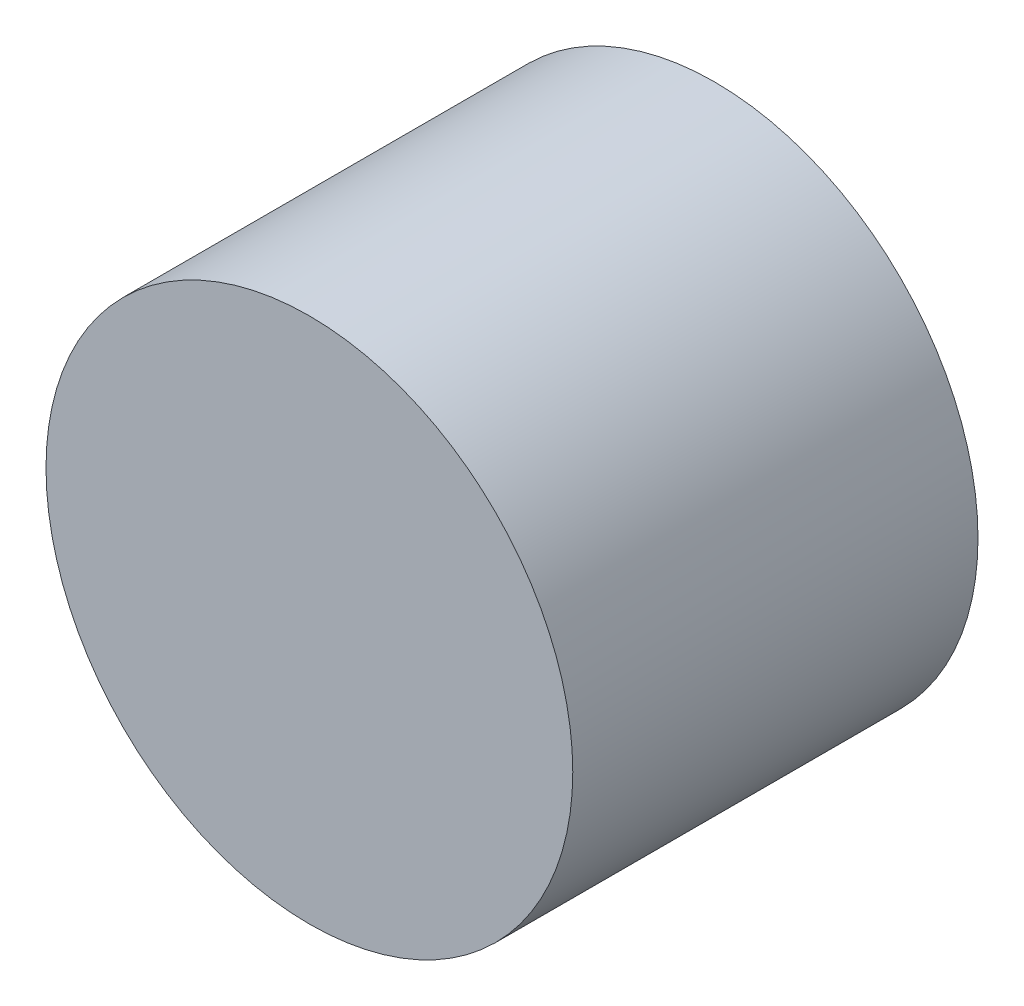
ISO-10303-21;
HEADER;
FILE_DESCRIPTION(('STEP AP214'),'2;1');
FILE_NAME('part.step','',(''),(''),'','','');
FILE_SCHEMA(('AUTOMOTIVE_DESIGN { 1 0 10303 214 1 1 1 1 }'));
ENDSEC;
DATA;
#1=APPLICATION_CONTEXT('core data for automotive mechanical design processes');
#2=APPLICATION_PROTOCOL_DEFINITION('international standard','automotive_design',2000,#1);
#3=PRODUCT_CONTEXT('',#1,'mechanical');
#4=PRODUCT('Part','Part','',(#3));
#5=PRODUCT_RELATED_PRODUCT_CATEGORY('part','',(#4));
#6=PRODUCT_DEFINITION_FORMATION('','',#4);
#7=PRODUCT_DEFINITION_CONTEXT('part definition',#1,'design');
#8=PRODUCT_DEFINITION('design','',#6,#7);
#9=PRODUCT_DEFINITION_SHAPE('','',#8);
#10=(LENGTH_UNIT() NAMED_UNIT(*) SI_UNIT(.MILLI.,.METRE.));
#11=(NAMED_UNIT(*) PLANE_ANGLE_UNIT() SI_UNIT($,.RADIAN.));
#12=(NAMED_UNIT(*) SI_UNIT($,.STERADIAN.) SOLID_ANGLE_UNIT());
#13=UNCERTAINTY_MEASURE_WITH_UNIT(LENGTH_MEASURE(1.E-05),#10,'distance_accuracy_value','');
#14=(GEOMETRIC_REPRESENTATION_CONTEXT(3) GLOBAL_UNCERTAINTY_ASSIGNED_CONTEXT((#13)) GLOBAL_UNIT_ASSIGNED_CONTEXT((#10,
#11,#12)) REPRESENTATION_CONTEXT('',''));
#15=CARTESIAN_POINT('',(0.,0.,0.));
#16=DIRECTION('',(0.,0.,1.));
#17=DIRECTION('',(1.,0.,0.));
#18=AXIS2_PLACEMENT_3D('',#15,#16,#17);
#19=CARTESIAN_POINT('',(0.,0.,6.35085296108584));
#20=DIRECTION('',(0.,0.,-1.));
#21=DIRECTION('',(-1.,0.,0.));
#22=AXIS2_PLACEMENT_3D('',#19,#20,#21);
#23=CONICAL_SURFACE('',#22,0.,1.0471975511966);
#24=CARTESIAN_POINT('',(0.,0.,0.));
#25=DIRECTION('',(0.,0.,1.));
#26=DIRECTION('',(1.,0.,0.));
#27=AXIS2_PLACEMENT_3D('',#24,#25,#26);
#28=CIRCLE('',#27,11.);
#29=CARTESIAN_POINT('',(11.,0.,0.));
#30=VERTEX_POINT('',#29);
#31=EDGE_CURVE('E13',#30,#30,#28,.T.);
#32=ORIENTED_EDGE('',*,*,#31,.F.);
#33=EDGE_LOOP('',(#32));
#34=FACE_BOUND('',#33,.T.);
#35=CARTESIAN_POINT('',(0.,0.,6.35085296108585));
#36=VERTEX_POINT('',#35);
#37=VERTEX_LOOP('',#36);
#38=FACE_BOUND('',#37,.T.);
#39=ADVANCED_FACE('F45',(#34,#38),#23,.F.);
#40=CARTESIAN_POINT('',(0.,11.,0.));
#41=DIRECTION('',(0.,0.,1.));
#42=DIRECTION('',(1.,0.,0.));
#43=AXIS2_PLACEMENT_3D('',#40,#41,#42);
#44=PLANE('',#43);
#45=CARTESIAN_POINT('',(0.,0.,0.));
#46=DIRECTION('',(0.,0.,1.));
#47=DIRECTION('',(1.,0.,0.));
#48=AXIS2_PLACEMENT_3D('',#45,#46,#47);
#49=CIRCLE('',#48,13.);
#50=CARTESIAN_POINT('',(13.,0.,0.));
#51=VERTEX_POINT('',#50);
#52=EDGE_CURVE('E51',#51,#51,#49,.T.);
#53=ORIENTED_EDGE('',*,*,#52,.F.);
#54=EDGE_LOOP('',(#53));
#55=FACE_BOUND('',#54,.T.);
#56=ORIENTED_EDGE('',*,*,#31,.T.);
#57=EDGE_LOOP('',(#56));
#58=FACE_BOUND('',#57,.T.);
#59=ADVANCED_FACE('F55',(#55,#58),#44,.F.);
#60=CARTESIAN_POINT('',(0.,0.,1000.));
#61=DIRECTION('',(0.,0.,1.));
#62=DIRECTION('',(1.,0.,0.));
#63=AXIS2_PLACEMENT_3D('',#60,#61,#62);
#64=CYLINDRICAL_SURFACE('',#63,13.);
#65=CARTESIAN_POINT('',(0.,0.,20.));
#66=DIRECTION('',(0.,0.,1.));
#67=DIRECTION('',(1.,0.,0.));
#68=AXIS2_PLACEMENT_3D('',#65,#66,#67);
#69=CIRCLE('',#68,13.);
#70=CARTESIAN_POINT('',(13.,0.,20.));
#71=VERTEX_POINT('',#70);
#72=EDGE_CURVE('E78',#71,#71,#69,.T.);
#73=ORIENTED_EDGE('',*,*,#72,.F.);
#74=EDGE_LOOP('',(#73));
#75=FACE_BOUND('',#74,.T.);
#76=ORIENTED_EDGE('',*,*,#52,.T.);
#77=EDGE_LOOP('',(#76));
#78=FACE_BOUND('',#77,.T.);
#79=ADVANCED_FACE('F60',(#75,#78),#64,.T.);
#80=CARTESIAN_POINT('',(0.,13.,20.));
#81=DIRECTION('',(0.,0.,-1.));
#82=DIRECTION('',(-1.,0.,0.));
#83=AXIS2_PLACEMENT_3D('',#80,#81,#82);
#84=PLANE('',#83);
#85=ORIENTED_EDGE('',*,*,#72,.T.);
#86=EDGE_LOOP('',(#85));
#87=FACE_BOUND('',#86,.T.);
#88=ADVANCED_FACE('F67',(#87),#84,.F.);
#89=CLOSED_SHELL('',(#39,#59,#79,#88));
#90=MANIFOLD_SOLID_BREP('B2',#89);
#91=ADVANCED_BREP_SHAPE_REPRESENTATION('',(#18,#90),#14);
#92=SHAPE_DEFINITION_REPRESENTATION(#9,#91);
ENDSEC;
END-ISO-10303-21;
